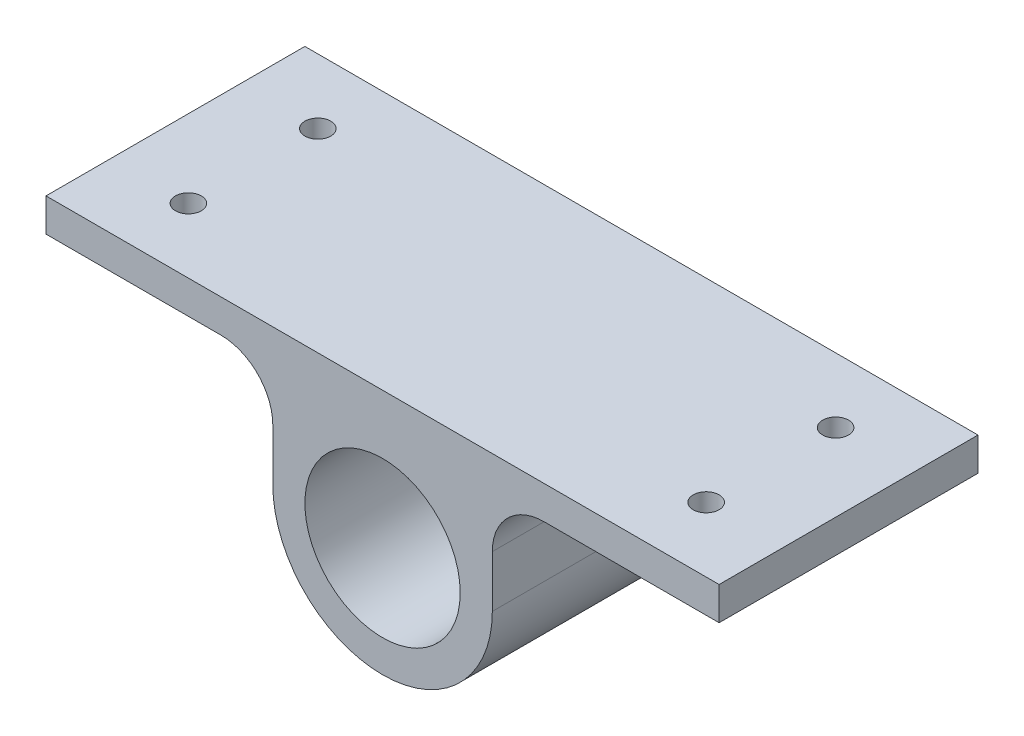
ISO-10303-21;
HEADER;
FILE_DESCRIPTION(('STEP AP214'),'2;1');
FILE_NAME('part.step','',(''),(''),'','','');
FILE_SCHEMA(('AUTOMOTIVE_DESIGN { 1 0 10303 214 1 1 1 1 }'));
ENDSEC;
DATA;
#1=APPLICATION_CONTEXT('core data for automotive mechanical design processes');
#2=APPLICATION_PROTOCOL_DEFINITION('international standard','automotive_design',2000,#1);
#3=PRODUCT_CONTEXT('',#1,'mechanical');
#4=PRODUCT('Part','Part','',(#3));
#5=PRODUCT_RELATED_PRODUCT_CATEGORY('part','',(#4));
#6=PRODUCT_DEFINITION_FORMATION('','',#4);
#7=PRODUCT_DEFINITION_CONTEXT('part definition',#1,'design');
#8=PRODUCT_DEFINITION('design','',#6,#7);
#9=PRODUCT_DEFINITION_SHAPE('','',#8);
#10=(LENGTH_UNIT() NAMED_UNIT(*) SI_UNIT(.MILLI.,.METRE.));
#11=(NAMED_UNIT(*) PLANE_ANGLE_UNIT() SI_UNIT($,.RADIAN.));
#12=(NAMED_UNIT(*) SI_UNIT($,.STERADIAN.) SOLID_ANGLE_UNIT());
#13=UNCERTAINTY_MEASURE_WITH_UNIT(LENGTH_MEASURE(1.E-05),#10,'distance_accuracy_value','');
#14=(GEOMETRIC_REPRESENTATION_CONTEXT(3) GLOBAL_UNCERTAINTY_ASSIGNED_CONTEXT((#13)) GLOBAL_UNIT_ASSIGNED_CONTEXT((#10,
#11,#12)) REPRESENTATION_CONTEXT('',''));
#15=CARTESIAN_POINT('',(0.,0.,0.));
#16=DIRECTION('',(0.,0.,1.));
#17=DIRECTION('',(1.,0.,0.));
#18=AXIS2_PLACEMENT_3D('',#15,#16,#17);
#19=CARTESIAN_POINT('',(-325.,100.,250.));
#20=DIRECTION('',(1.,0.,0.));
#21=DIRECTION('',(0.,0.,-1.));
#22=AXIS2_PLACEMENT_3D('',#19,#20,#21);
#23=PLANE('',#22);
#24=DIRECTION('',(0.,-1.,0.));
#25=VECTOR('',#24,1.);
#26=CARTESIAN_POINT('',(-325.,100.,0.));
#27=LINE('',#26,#25);
#28=CARTESIAN_POINT('',(-325.,132.,0.));
#29=VERTEX_POINT('',#28);
#30=CARTESIAN_POINT('',(-325.,100.,0.));
#31=VERTEX_POINT('',#30);
#32=EDGE_CURVE('E158',#29,#31,#27,.T.);
#33=ORIENTED_EDGE('',*,*,#32,.T.);
#34=DIRECTION('',(0.,0.,-1.));
#35=VECTOR('',#34,1.);
#36=CARTESIAN_POINT('',(-325.,100.,250.));
#37=LINE('',#36,#35);
#38=CARTESIAN_POINT('',(-325.,100.,250.));
#39=VERTEX_POINT('',#38);
#40=EDGE_CURVE('E11',#39,#31,#37,.T.);
#41=ORIENTED_EDGE('',*,*,#40,.F.);
#42=DIRECTION('',(0.,-1.,0.));
#43=VECTOR('',#42,1.);
#44=CARTESIAN_POINT('',(-325.,100.,250.));
#45=LINE('',#44,#43);
#46=CARTESIAN_POINT('',(-325.,132.,250.));
#47=VERTEX_POINT('',#46);
#48=EDGE_CURVE('E186',#47,#39,#45,.T.);
#49=ORIENTED_EDGE('',*,*,#48,.F.);
#50=DIRECTION('',(0.,0.,-1.));
#51=VECTOR('',#50,1.);
#52=CARTESIAN_POINT('',(-325.,132.,250.));
#53=LINE('',#52,#51);
#54=EDGE_CURVE('E154',#47,#29,#53,.T.);
#55=ORIENTED_EDGE('',*,*,#54,.T.);
#56=EDGE_LOOP('',(#33,#41,#49,#55));
#57=FACE_BOUND('',#56,.T.);
#58=ADVANCED_FACE('F43',(#57),#23,.F.);
#59=CARTESIAN_POINT('',(-156.,100.,250.));
#60=DIRECTION('',(0.,1.,0.));
#61=DIRECTION('',(-1.,0.,0.));
#62=AXIS2_PLACEMENT_3D('',#59,#60,#61);
#63=PLANE('',#62);
#64=CARTESIAN_POINT('',(-250.,99.9999999999999,187.5));
#65=DIRECTION('',(0.,1.,0.));
#66=DIRECTION('',(-1.,0.,0.));
#67=AXIS2_PLACEMENT_3D('',#64,#65,#66);
#68=CIRCLE('',#67,12.5);
#69=CARTESIAN_POINT('',(-262.5,99.9999999999999,187.5));
#70=VERTEX_POINT('',#69);
#71=EDGE_CURVE('E245',#70,#70,#68,.T.);
#72=ORIENTED_EDGE('',*,*,#71,.T.);
#73=EDGE_LOOP('',(#72));
#74=FACE_BOUND('',#73,.T.);
#75=CARTESIAN_POINT('',(-250.,99.9999999999999,62.5));
#76=DIRECTION('',(0.,1.,0.));
#77=DIRECTION('',(-1.,0.,0.));
#78=AXIS2_PLACEMENT_3D('',#75,#76,#77);
#79=CIRCLE('',#78,12.5);
#80=CARTESIAN_POINT('',(-262.5,99.9999999999999,62.5));
#81=VERTEX_POINT('',#80);
#82=EDGE_CURVE('E255',#81,#81,#79,.T.);
#83=ORIENTED_EDGE('',*,*,#82,.T.);
#84=EDGE_LOOP('',(#83));
#85=FACE_BOUND('',#84,.T.);
#86=DIRECTION('',(1.,0.,0.));
#87=VECTOR('',#86,1.);
#88=CARTESIAN_POINT('',(-156.,100.,0.));
#89=LINE('',#88,#87);
#90=CARTESIAN_POINT('',(-156.,100.,0.));
#91=VERTEX_POINT('',#90);
#92=EDGE_CURVE('E161',#31,#91,#89,.T.);
#93=ORIENTED_EDGE('',*,*,#92,.T.);
#94=DIRECTION('',(0.,0.,-1.));
#95=VECTOR('',#94,1.);
#96=CARTESIAN_POINT('',(-156.,100.,250.));
#97=LINE('',#96,#95);
#98=CARTESIAN_POINT('',(-156.,100.,250.));
#99=VERTEX_POINT('',#98);
#100=EDGE_CURVE('E52',#99,#91,#97,.T.);
#101=ORIENTED_EDGE('',*,*,#100,.F.);
#102=DIRECTION('',(1.,0.,0.));
#103=VECTOR('',#102,1.);
#104=CARTESIAN_POINT('',(-156.,100.,250.));
#105=LINE('',#104,#103);
#106=EDGE_CURVE('E109',#39,#99,#105,.T.);
#107=ORIENTED_EDGE('',*,*,#106,.F.);
#108=ORIENTED_EDGE('',*,*,#40,.T.);
#109=EDGE_LOOP('',(#93,#101,#107,#108));
#110=FACE_BOUND('',#109,.T.);
#111=ADVANCED_FACE('F274',(#74,#85,#110),#63,.F.);
#112=CARTESIAN_POINT('',(-156.,50.,250.));
#113=DIRECTION('',(0.,0.,-1.));
#114=DIRECTION('',(-1.,0.,0.));
#115=AXIS2_PLACEMENT_3D('',#112,#113,#114);
#116=CYLINDRICAL_SURFACE('',#115,50.);
#117=CARTESIAN_POINT('',(-156.,50.,0.));
#118=DIRECTION('',(0.,0.,-1.));
#119=DIRECTION('',(1.,0.,0.));
#120=AXIS2_PLACEMENT_3D('',#117,#118,#119);
#121=CIRCLE('',#120,50.);
#122=CARTESIAN_POINT('',(-106.,49.9999999999996,0.));
#123=VERTEX_POINT('',#122);
#124=EDGE_CURVE('E165',#91,#123,#121,.T.);
#125=ORIENTED_EDGE('',*,*,#124,.T.);
#126=DIRECTION('',(0.,0.,-1.));
#127=VECTOR('',#126,1.);
#128=CARTESIAN_POINT('',(-106.,49.9999999999996,250.));
#129=LINE('',#128,#127);
#130=CARTESIAN_POINT('',(-106.,49.9999999999996,250.));
#131=VERTEX_POINT('',#130);
#132=EDGE_CURVE('E204',#131,#123,#129,.T.);
#133=ORIENTED_EDGE('',*,*,#132,.F.);
#134=CARTESIAN_POINT('',(-156.,50.,250.));
#135=DIRECTION('',(0.,0.,-1.));
#136=DIRECTION('',(1.,0.,0.));
#137=AXIS2_PLACEMENT_3D('',#134,#135,#136);
#138=CIRCLE('',#137,50.);
#139=EDGE_CURVE('E214',#99,#131,#138,.T.);
#140=ORIENTED_EDGE('',*,*,#139,.F.);
#141=ORIENTED_EDGE('',*,*,#100,.T.);
#142=EDGE_LOOP('',(#125,#133,#140,#141));
#143=FACE_BOUND('',#142,.T.);
#144=ADVANCED_FACE('F212',(#143),#116,.F.);
#145=CARTESIAN_POINT('',(-106.,0.,250.));
#146=DIRECTION('',(1.,0.,0.));
#147=DIRECTION('',(0.,0.,-1.));
#148=AXIS2_PLACEMENT_3D('',#145,#146,#147);
#149=PLANE('',#148);
#150=DIRECTION('',(0.,-1.,0.));
#151=VECTOR('',#150,1.);
#152=CARTESIAN_POINT('',(-106.,0.,0.));
#153=LINE('',#152,#151);
#154=CARTESIAN_POINT('',(-106.,0.,0.));
#155=VERTEX_POINT('',#154);
#156=EDGE_CURVE('E168',#123,#155,#153,.T.);
#157=ORIENTED_EDGE('',*,*,#156,.T.);
#158=DIRECTION('',(0.,0.,-1.));
#159=VECTOR('',#158,1.);
#160=CARTESIAN_POINT('',(-106.,0.,250.));
#161=LINE('',#160,#159);
#162=CARTESIAN_POINT('',(-106.,0.,250.));
#163=VERTEX_POINT('',#162);
#164=EDGE_CURVE('E200',#163,#155,#161,.T.);
#165=ORIENTED_EDGE('',*,*,#164,.F.);
#166=DIRECTION('',(0.,-1.,0.));
#167=VECTOR('',#166,1.);
#168=CARTESIAN_POINT('',(-106.,0.,250.));
#169=LINE('',#168,#167);
#170=EDGE_CURVE('E233',#131,#163,#169,.T.);
#171=ORIENTED_EDGE('',*,*,#170,.F.);
#172=ORIENTED_EDGE('',*,*,#132,.T.);
#173=EDGE_LOOP('',(#157,#165,#171,#172));
#174=FACE_BOUND('',#173,.T.);
#175=ADVANCED_FACE('F223',(#174),#149,.F.);
#176=CARTESIAN_POINT('',(0.,0.,250.));
#177=DIRECTION('',(0.,0.,-1.));
#178=DIRECTION('',(-1.,0.,0.));
#179=AXIS2_PLACEMENT_3D('',#176,#177,#178);
#180=CYLINDRICAL_SURFACE('',#179,106.);
#181=CARTESIAN_POINT('',(0.,0.,0.));
#182=DIRECTION('',(0.,0.,1.));
#183=DIRECTION('',(-1.,0.,0.));
#184=AXIS2_PLACEMENT_3D('',#181,#182,#183);
#185=CIRCLE('',#184,106.);
#186=CARTESIAN_POINT('',(106.,0.,0.));
#187=VERTEX_POINT('',#186);
#188=EDGE_CURVE('E171',#155,#187,#185,.T.);
#189=ORIENTED_EDGE('',*,*,#188,.T.);
#190=DIRECTION('',(0.,0.,-1.));
#191=VECTOR('',#190,1.);
#192=CARTESIAN_POINT('',(106.,0.,250.));
#193=LINE('',#192,#191);
#194=CARTESIAN_POINT('',(106.,0.,250.));
#195=VERTEX_POINT('',#194);
#196=EDGE_CURVE('E196',#195,#187,#193,.T.);
#197=ORIENTED_EDGE('',*,*,#196,.F.);
#198=CARTESIAN_POINT('',(0.,0.,250.));
#199=DIRECTION('',(0.,0.,1.));
#200=DIRECTION('',(-1.,0.,0.));
#201=AXIS2_PLACEMENT_3D('',#198,#199,#200);
#202=CIRCLE('',#201,106.);
#203=EDGE_CURVE('E229',#163,#195,#202,.T.);
#204=ORIENTED_EDGE('',*,*,#203,.F.);
#205=ORIENTED_EDGE('',*,*,#164,.T.);
#206=EDGE_LOOP('',(#189,#197,#204,#205));
#207=FACE_BOUND('',#206,.T.);
#208=ADVANCED_FACE('F227',(#207),#180,.T.);
#209=CARTESIAN_POINT('',(106.,49.9999999999996,250.));
#210=DIRECTION('',(-1.,0.,0.));
#211=DIRECTION('',(0.,-1.,0.));
#212=AXIS2_PLACEMENT_3D('',#209,#210,#211);
#213=PLANE('',#212);
#214=DIRECTION('',(0.,1.,0.));
#215=VECTOR('',#214,1.);
#216=CARTESIAN_POINT('',(106.,49.9999999999996,0.));
#217=LINE('',#216,#215);
#218=CARTESIAN_POINT('',(106.,49.9999999999996,0.));
#219=VERTEX_POINT('',#218);
#220=EDGE_CURVE('E174',#187,#219,#217,.T.);
#221=ORIENTED_EDGE('',*,*,#220,.T.);
#222=DIRECTION('',(0.,0.,-1.));
#223=VECTOR('',#222,1.);
#224=CARTESIAN_POINT('',(106.,49.9999999999996,250.));
#225=LINE('',#224,#223);
#226=CARTESIAN_POINT('',(106.,49.9999999999996,250.));
#227=VERTEX_POINT('',#226);
#228=EDGE_CURVE('E192',#227,#219,#225,.T.);
#229=ORIENTED_EDGE('',*,*,#228,.F.);
#230=DIRECTION('',(0.,1.,0.));
#231=VECTOR('',#230,1.);
#232=CARTESIAN_POINT('',(106.,49.9999999999996,250.));
#233=LINE('',#232,#231);
#234=EDGE_CURVE('E232',#195,#227,#233,.T.);
#235=ORIENTED_EDGE('',*,*,#234,.F.);
#236=ORIENTED_EDGE('',*,*,#196,.T.);
#237=EDGE_LOOP('',(#221,#229,#235,#236));
#238=FACE_BOUND('',#237,.T.);
#239=ADVANCED_FACE('F287',(#238),#213,.F.);
#240=CARTESIAN_POINT('',(156.,50.,250.));
#241=DIRECTION('',(0.,0.,-1.));
#242=DIRECTION('',(-1.,0.,0.));
#243=AXIS2_PLACEMENT_3D('',#240,#241,#242);
#244=CYLINDRICAL_SURFACE('',#243,50.);
#245=CARTESIAN_POINT('',(156.,50.,0.));
#246=DIRECTION('',(0.,0.,-1.));
#247=DIRECTION('',(-1.,0.,0.));
#248=AXIS2_PLACEMENT_3D('',#245,#246,#247);
#249=CIRCLE('',#248,50.);
#250=CARTESIAN_POINT('',(156.,100.,0.));
#251=VERTEX_POINT('',#250);
#252=EDGE_CURVE('E177',#219,#251,#249,.T.);
#253=ORIENTED_EDGE('',*,*,#252,.T.);
#254=DIRECTION('',(0.,0.,-1.));
#255=VECTOR('',#254,1.);
#256=CARTESIAN_POINT('',(156.,100.,250.));
#257=LINE('',#256,#255);
#258=CARTESIAN_POINT('',(156.,100.,250.));
#259=VERTEX_POINT('',#258);
#260=EDGE_CURVE('E145',#259,#251,#257,.T.);
#261=ORIENTED_EDGE('',*,*,#260,.F.);
#262=CARTESIAN_POINT('',(156.,50.,250.));
#263=DIRECTION('',(0.,0.,-1.));
#264=DIRECTION('',(-1.,0.,0.));
#265=AXIS2_PLACEMENT_3D('',#262,#263,#264);
#266=CIRCLE('',#265,50.);
#267=EDGE_CURVE('E134',#227,#259,#266,.T.);
#268=ORIENTED_EDGE('',*,*,#267,.F.);
#269=ORIENTED_EDGE('',*,*,#228,.T.);
#270=EDGE_LOOP('',(#253,#261,#268,#269));
#271=FACE_BOUND('',#270,.T.);
#272=ADVANCED_FACE('F290',(#271),#244,.F.);
#273=CARTESIAN_POINT('',(325.,100.,250.));
#274=DIRECTION('',(0.,1.,0.));
#275=DIRECTION('',(-1.,0.,0.));
#276=AXIS2_PLACEMENT_3D('',#273,#274,#275);
#277=PLANE('',#276);
#278=CARTESIAN_POINT('',(250.,100.,62.5));
#279=DIRECTION('',(0.,1.,0.));
#280=DIRECTION('',(-1.,0.,0.));
#281=AXIS2_PLACEMENT_3D('',#278,#279,#280);
#282=CIRCLE('',#281,12.5);
#283=CARTESIAN_POINT('',(237.5,100.,62.5));
#284=VERTEX_POINT('',#283);
#285=EDGE_CURVE('E244',#284,#284,#282,.T.);
#286=ORIENTED_EDGE('',*,*,#285,.T.);
#287=EDGE_LOOP('',(#286));
#288=FACE_BOUND('',#287,.T.);
#289=CARTESIAN_POINT('',(250.,100.,187.5));
#290=DIRECTION('',(0.,1.,0.));
#291=DIRECTION('',(-1.,0.,0.));
#292=AXIS2_PLACEMENT_3D('',#289,#290,#291);
#293=CIRCLE('',#292,12.5);
#294=CARTESIAN_POINT('',(237.5,100.,187.5));
#295=VERTEX_POINT('',#294);
#296=EDGE_CURVE('E242',#295,#295,#293,.T.);
#297=ORIENTED_EDGE('',*,*,#296,.T.);
#298=EDGE_LOOP('',(#297));
#299=FACE_BOUND('',#298,.T.);
#300=DIRECTION('',(1.,0.,0.));
#301=VECTOR('',#300,1.);
#302=CARTESIAN_POINT('',(325.,100.,0.));
#303=LINE('',#302,#301);
#304=CARTESIAN_POINT('',(325.,100.,0.));
#305=VERTEX_POINT('',#304);
#306=EDGE_CURVE('E143',#251,#305,#303,.T.);
#307=ORIENTED_EDGE('',*,*,#306,.T.);
#308=DIRECTION('',(0.,0.,-1.));
#309=VECTOR('',#308,1.);
#310=CARTESIAN_POINT('',(325.,100.,250.));
#311=LINE('',#310,#309);
#312=CARTESIAN_POINT('',(325.,100.,250.));
#313=VERTEX_POINT('',#312);
#314=EDGE_CURVE('E140',#313,#305,#311,.T.);
#315=ORIENTED_EDGE('',*,*,#314,.F.);
#316=DIRECTION('',(1.,0.,0.));
#317=VECTOR('',#316,1.);
#318=CARTESIAN_POINT('',(325.,100.,250.));
#319=LINE('',#318,#317);
#320=EDGE_CURVE('E128',#259,#313,#319,.T.);
#321=ORIENTED_EDGE('',*,*,#320,.F.);
#322=ORIENTED_EDGE('',*,*,#260,.T.);
#323=EDGE_LOOP('',(#307,#315,#321,#322));
#324=FACE_BOUND('',#323,.T.);
#325=ADVANCED_FACE('F141',(#288,#299,#324),#277,.F.);
#326=CARTESIAN_POINT('',(325.,132.,250.));
#327=DIRECTION('',(-1.,0.,0.));
#328=DIRECTION('',(0.,0.,1.));
#329=AXIS2_PLACEMENT_3D('',#326,#327,#328);
#330=PLANE('',#329);
#331=DIRECTION('',(0.,1.,0.));
#332=VECTOR('',#331,1.);
#333=CARTESIAN_POINT('',(325.,132.,0.));
#334=LINE('',#333,#332);
#335=CARTESIAN_POINT('',(325.,132.,0.));
#336=VERTEX_POINT('',#335);
#337=EDGE_CURVE('E95',#305,#336,#334,.T.);
#338=ORIENTED_EDGE('',*,*,#337,.T.);
#339=DIRECTION('',(0.,0.,-1.));
#340=VECTOR('',#339,1.);
#341=CARTESIAN_POINT('',(325.,132.,250.));
#342=LINE('',#341,#340);
#343=CARTESIAN_POINT('',(325.,132.,250.));
#344=VERTEX_POINT('',#343);
#345=EDGE_CURVE('E146',#344,#336,#342,.T.);
#346=ORIENTED_EDGE('',*,*,#345,.F.);
#347=DIRECTION('',(0.,1.,0.));
#348=VECTOR('',#347,1.);
#349=CARTESIAN_POINT('',(325.,132.,250.));
#350=LINE('',#349,#348);
#351=EDGE_CURVE('E132',#313,#344,#350,.T.);
#352=ORIENTED_EDGE('',*,*,#351,.F.);
#353=ORIENTED_EDGE('',*,*,#314,.T.);
#354=EDGE_LOOP('',(#338,#346,#352,#353));
#355=FACE_BOUND('',#354,.T.);
#356=ADVANCED_FACE('F148',(#355),#330,.F.);
#357=CARTESIAN_POINT('',(-325.,132.,250.));
#358=DIRECTION('',(0.,-1.,0.));
#359=DIRECTION('',(0.,0.,-1.));
#360=AXIS2_PLACEMENT_3D('',#357,#358,#359);
#361=PLANE('',#360);
#362=CARTESIAN_POINT('',(250.,132.,62.5));
#363=DIRECTION('',(0.,1.,0.));
#364=DIRECTION('',(0.,0.,-1.));
#365=AXIS2_PLACEMENT_3D('',#362,#363,#364);
#366=CIRCLE('',#365,12.5);
#367=CARTESIAN_POINT('',(250.,132.,50.));
#368=VERTEX_POINT('',#367);
#369=EDGE_CURVE('E344',#368,#368,#366,.T.);
#370=ORIENTED_EDGE('',*,*,#369,.F.);
#371=EDGE_LOOP('',(#370));
#372=FACE_BOUND('',#371,.T.);
#373=CARTESIAN_POINT('',(250.,132.,187.5));
#374=DIRECTION('',(0.,1.,0.));
#375=DIRECTION('',(0.,0.,-1.));
#376=AXIS2_PLACEMENT_3D('',#373,#374,#375);
#377=CIRCLE('',#376,12.5);
#378=CARTESIAN_POINT('',(250.,132.,175.));
#379=VERTEX_POINT('',#378);
#380=EDGE_CURVE('E338',#379,#379,#377,.T.);
#381=ORIENTED_EDGE('',*,*,#380,.F.);
#382=EDGE_LOOP('',(#381));
#383=FACE_BOUND('',#382,.T.);
#384=CARTESIAN_POINT('',(-250.,132.,187.5));
#385=DIRECTION('',(0.,1.,0.));
#386=DIRECTION('',(0.,0.,1.));
#387=AXIS2_PLACEMENT_3D('',#384,#385,#386);
#388=CIRCLE('',#387,12.5);
#389=CARTESIAN_POINT('',(-250.,132.,200.));
#390=VERTEX_POINT('',#389);
#391=EDGE_CURVE('E333',#390,#390,#388,.T.);
#392=ORIENTED_EDGE('',*,*,#391,.F.);
#393=EDGE_LOOP('',(#392));
#394=FACE_BOUND('',#393,.T.);
#395=CARTESIAN_POINT('',(-250.,132.,62.5));
#396=DIRECTION('',(0.,1.,0.));
#397=DIRECTION('',(0.,0.,1.));
#398=AXIS2_PLACEMENT_3D('',#395,#396,#397);
#399=CIRCLE('',#398,12.5);
#400=CARTESIAN_POINT('',(-250.,132.,75.));
#401=VERTEX_POINT('',#400);
#402=EDGE_CURVE('E337',#401,#401,#399,.T.);
#403=ORIENTED_EDGE('',*,*,#402,.F.);
#404=EDGE_LOOP('',(#403));
#405=FACE_BOUND('',#404,.T.);
#406=DIRECTION('',(-1.,0.,0.));
#407=VECTOR('',#406,1.);
#408=CARTESIAN_POINT('',(-325.,132.,0.));
#409=LINE('',#408,#407);
#410=EDGE_CURVE('E101',#336,#29,#409,.T.);
#411=ORIENTED_EDGE('',*,*,#410,.T.);
#412=ORIENTED_EDGE('',*,*,#54,.F.);
#413=DIRECTION('',(-1.,0.,0.));
#414=VECTOR('',#413,1.);
#415=CARTESIAN_POINT('',(-325.,132.,250.));
#416=LINE('',#415,#414);
#417=EDGE_CURVE('E60',#344,#47,#416,.T.);
#418=ORIENTED_EDGE('',*,*,#417,.F.);
#419=ORIENTED_EDGE('',*,*,#345,.T.);
#420=EDGE_LOOP('',(#411,#412,#418,#419));
#421=FACE_BOUND('',#420,.T.);
#422=ADVANCED_FACE('F300',(#372,#383,#394,#405,#421),#361,.F.);
#423=CARTESIAN_POINT('',(156.,50.,250.));
#424=DIRECTION('',(0.,0.,-1.));
#425=DIRECTION('',(-1.,0.,0.));
#426=AXIS2_PLACEMENT_3D('',#423,#424,#425);
#427=PLANE('',#426);
#428=CARTESIAN_POINT('',(0.,0.,250.));
#429=DIRECTION('',(0.,0.,1.));
#430=DIRECTION('',(1.,0.,0.));
#431=AXIS2_PLACEMENT_3D('',#428,#429,#430);
#432=CIRCLE('',#431,75.);
#433=CARTESIAN_POINT('',(75.,0.,250.));
#434=VERTEX_POINT('',#433);
#435=EDGE_CURVE('E251',#434,#434,#432,.T.);
#436=ORIENTED_EDGE('',*,*,#435,.F.);
#437=EDGE_LOOP('',(#436));
#438=FACE_BOUND('',#437,.T.);
#439=ORIENTED_EDGE('',*,*,#48,.T.);
#440=ORIENTED_EDGE('',*,*,#106,.T.);
#441=ORIENTED_EDGE('',*,*,#139,.T.);
#442=ORIENTED_EDGE('',*,*,#170,.T.);
#443=ORIENTED_EDGE('',*,*,#203,.T.);
#444=ORIENTED_EDGE('',*,*,#234,.T.);
#445=ORIENTED_EDGE('',*,*,#267,.T.);
#446=ORIENTED_EDGE('',*,*,#320,.T.);
#447=ORIENTED_EDGE('',*,*,#351,.T.);
#448=ORIENTED_EDGE('',*,*,#417,.T.);
#449=EDGE_LOOP('',(#439,#440,#441,#442,#443,#444,#445,#446,#447,#448));
#450=FACE_BOUND('',#449,.T.);
#451=ADVANCED_FACE('F130',(#438,#450),#427,.F.);
#452=CARTESIAN_POINT('',(156.,50.,0.));
#453=DIRECTION('',(0.,0.,-1.));
#454=DIRECTION('',(-1.,0.,0.));
#455=AXIS2_PLACEMENT_3D('',#452,#453,#454);
#456=PLANE('',#455);
#457=CARTESIAN_POINT('',(0.,0.,0.));
#458=DIRECTION('',(0.,0.,1.));
#459=DIRECTION('',(1.,0.,0.));
#460=AXIS2_PLACEMENT_3D('',#457,#458,#459);
#461=CIRCLE('',#460,75.);
#462=CARTESIAN_POINT('',(75.,0.,0.));
#463=VERTEX_POINT('',#462);
#464=EDGE_CURVE('E162',#463,#463,#461,.T.);
#465=ORIENTED_EDGE('',*,*,#464,.T.);
#466=EDGE_LOOP('',(#465));
#467=FACE_BOUND('',#466,.T.);
#468=ORIENTED_EDGE('',*,*,#32,.F.);
#469=ORIENTED_EDGE('',*,*,#410,.F.);
#470=ORIENTED_EDGE('',*,*,#337,.F.);
#471=ORIENTED_EDGE('',*,*,#306,.F.);
#472=ORIENTED_EDGE('',*,*,#252,.F.);
#473=ORIENTED_EDGE('',*,*,#220,.F.);
#474=ORIENTED_EDGE('',*,*,#188,.F.);
#475=ORIENTED_EDGE('',*,*,#156,.F.);
#476=ORIENTED_EDGE('',*,*,#124,.F.);
#477=ORIENTED_EDGE('',*,*,#92,.F.);
#478=EDGE_LOOP('',(#468,#469,#470,#471,#472,#473,#474,#475,#476,#477));
#479=FACE_BOUND('',#478,.T.);
#480=ADVANCED_FACE('F218',(#467,#479),#456,.T.);
#481=CARTESIAN_POINT('',(0.,0.,0.));
#482=DIRECTION('',(0.,0.,1.));
#483=DIRECTION('',(1.,0.,0.));
#484=AXIS2_PLACEMENT_3D('',#481,#482,#483);
#485=CYLINDRICAL_SURFACE('',#484,75.);
#486=ORIENTED_EDGE('',*,*,#464,.F.);
#487=EDGE_LOOP('',(#486));
#488=FACE_BOUND('',#487,.T.);
#489=ORIENTED_EDGE('',*,*,#435,.T.);
#490=EDGE_LOOP('',(#489));
#491=FACE_BOUND('',#490,.T.);
#492=ADVANCED_FACE('F306',(#488,#491),#485,.F.);
#493=CARTESIAN_POINT('',(-250.,-118.,62.5));
#494=DIRECTION('',(0.,1.,0.));
#495=DIRECTION('',(0.,0.,1.));
#496=AXIS2_PLACEMENT_3D('',#493,#494,#495);
#497=CYLINDRICAL_SURFACE('',#496,12.5);
#498=ORIENTED_EDGE('',*,*,#402,.T.);
#499=EDGE_LOOP('',(#498));
#500=FACE_BOUND('',#499,.T.);
#501=ORIENTED_EDGE('',*,*,#82,.F.);
#502=EDGE_LOOP('',(#501));
#503=FACE_BOUND('',#502,.T.);
#504=ADVANCED_FACE('F313',(#500,#503),#497,.F.);
#505=CARTESIAN_POINT('',(-250.,-118.,187.5));
#506=DIRECTION('',(0.,1.,0.));
#507=DIRECTION('',(0.,0.,1.));
#508=AXIS2_PLACEMENT_3D('',#505,#506,#507);
#509=CYLINDRICAL_SURFACE('',#508,12.5);
#510=ORIENTED_EDGE('',*,*,#391,.T.);
#511=EDGE_LOOP('',(#510));
#512=FACE_BOUND('',#511,.T.);
#513=ORIENTED_EDGE('',*,*,#71,.F.);
#514=EDGE_LOOP('',(#513));
#515=FACE_BOUND('',#514,.T.);
#516=ADVANCED_FACE('F317',(#512,#515),#509,.F.);
#517=CARTESIAN_POINT('',(250.,-118.,187.5));
#518=DIRECTION('',(0.,1.,0.));
#519=DIRECTION('',(0.,0.,1.));
#520=AXIS2_PLACEMENT_3D('',#517,#518,#519);
#521=CYLINDRICAL_SURFACE('',#520,12.5);
#522=ORIENTED_EDGE('',*,*,#380,.T.);
#523=EDGE_LOOP('',(#522));
#524=FACE_BOUND('',#523,.T.);
#525=ORIENTED_EDGE('',*,*,#296,.F.);
#526=EDGE_LOOP('',(#525));
#527=FACE_BOUND('',#526,.T.);
#528=ADVANCED_FACE('F322',(#524,#527),#521,.F.);
#529=CARTESIAN_POINT('',(250.,-118.,62.5));
#530=DIRECTION('',(0.,1.,0.));
#531=DIRECTION('',(0.,0.,1.));
#532=AXIS2_PLACEMENT_3D('',#529,#530,#531);
#533=CYLINDRICAL_SURFACE('',#532,12.5);
#534=ORIENTED_EDGE('',*,*,#369,.T.);
#535=EDGE_LOOP('',(#534));
#536=FACE_BOUND('',#535,.T.);
#537=ORIENTED_EDGE('',*,*,#285,.F.);
#538=EDGE_LOOP('',(#537));
#539=FACE_BOUND('',#538,.T.);
#540=ADVANCED_FACE('F319',(#536,#539),#533,.F.);
#541=CLOSED_SHELL('',(#58,#111,#144,#175,#208,#239,#272,#325,#356,#422,#451,#480,#492,#504,#516,
#528,#540));
#542=MANIFOLD_SOLID_BREP('B2',#541);
#543=ADVANCED_BREP_SHAPE_REPRESENTATION('',(#18,#542),#14);
#544=SHAPE_DEFINITION_REPRESENTATION(#9,#543);
ENDSEC;
END-ISO-10303-21;
